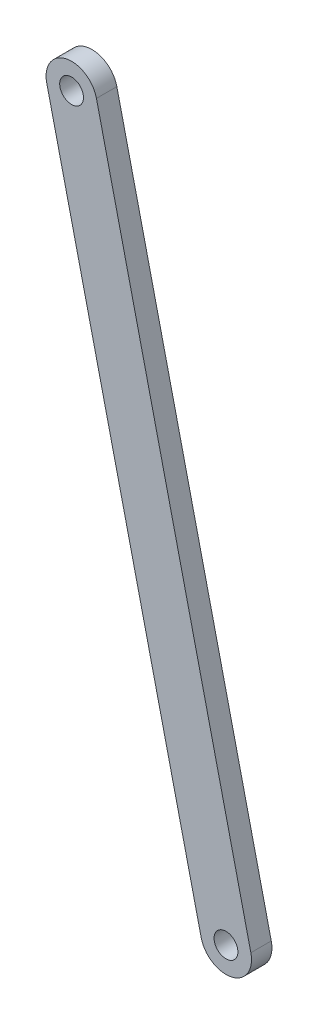
ISO-10303-21;
HEADER;
FILE_DESCRIPTION(('STEP AP214'),'2;1');
FILE_NAME('part.step','',(''),(''),'','','');
FILE_SCHEMA(('AUTOMOTIVE_DESIGN { 1 0 10303 214 1 1 1 1 }'));
ENDSEC;
DATA;
#1=APPLICATION_CONTEXT('core data for automotive mechanical design processes');
#2=APPLICATION_PROTOCOL_DEFINITION('international standard','automotive_design',2000,#1);
#3=PRODUCT_CONTEXT('',#1,'mechanical');
#4=PRODUCT('Part','Part','',(#3));
#5=PRODUCT_RELATED_PRODUCT_CATEGORY('part','',(#4));
#6=PRODUCT_DEFINITION_FORMATION('','',#4);
#7=PRODUCT_DEFINITION_CONTEXT('part definition',#1,'design');
#8=PRODUCT_DEFINITION('design','',#6,#7);
#9=PRODUCT_DEFINITION_SHAPE('','',#8);
#10=(LENGTH_UNIT() NAMED_UNIT(*) SI_UNIT(.MILLI.,.METRE.));
#11=(NAMED_UNIT(*) PLANE_ANGLE_UNIT() SI_UNIT($,.RADIAN.));
#12=(NAMED_UNIT(*) SI_UNIT($,.STERADIAN.) SOLID_ANGLE_UNIT());
#13=UNCERTAINTY_MEASURE_WITH_UNIT(LENGTH_MEASURE(1.E-05),#10,'distance_accuracy_value','');
#14=(GEOMETRIC_REPRESENTATION_CONTEXT(3) GLOBAL_UNCERTAINTY_ASSIGNED_CONTEXT((#13)) GLOBAL_UNIT_ASSIGNED_CONTEXT((#10,
#11,#12)) REPRESENTATION_CONTEXT('',''));
#15=CARTESIAN_POINT('',(0.,0.,0.));
#16=DIRECTION('',(0.,0.,1.));
#17=DIRECTION('',(1.,0.,0.));
#18=AXIS2_PLACEMENT_3D('',#15,#16,#17);
#19=CARTESIAN_POINT('',(-45.3825388255271,-53.2956393127011,6.));
#20=DIRECTION('',(0.,0.,1.));
#21=DIRECTION('',(1.,0.,0.));
#22=AXIS2_PLACEMENT_3D('',#19,#20,#21);
#23=PLANE('',#22);
#24=CARTESIAN_POINT('',(-45.3825388255271,-53.2956393127011,6.));
#25=DIRECTION('',(0.,0.,1.));
#26=DIRECTION('',(1.,0.,0.));
#27=AXIS2_PLACEMENT_3D('',#24,#25,#26);
#28=CIRCLE('',#27,3.5);
#29=CARTESIAN_POINT('',(-41.8825388255271,-53.2956393127011,6.));
#30=VERTEX_POINT('',#29);
#31=EDGE_CURVE('E100',#30,#30,#28,.T.);
#32=ORIENTED_EDGE('',*,*,#31,.F.);
#33=EDGE_LOOP('',(#32));
#34=FACE_BOUND('',#33,.T.);
#35=CARTESIAN_POINT('',(-45.3825388255271,-53.2956393127011,6.));
#36=DIRECTION('',(0.,0.,1.));
#37=DIRECTION('',(1.,0.,0.));
#38=AXIS2_PLACEMENT_3D('',#35,#36,#37);
#39=CIRCLE('',#38,7.5);
#40=CARTESIAN_POINT('',(-38.0781755476664,-51.5937941067438,6.));
#41=VERTEX_POINT('',#40);
#42=CARTESIAN_POINT('',(-52.6869021033878,-54.9974845186583,6.));
#43=VERTEX_POINT('',#42);
#44=EDGE_CURVE('E85',#41,#43,#39,.T.);
#45=ORIENTED_EDGE('',*,*,#44,.T.);
#46=DIRECTION('',(0.226912694127635,-0.973915103714763,0.));
#47=VECTOR('',#46,1.);
#48=CARTESIAN_POINT('',(-52.6869021033878,-54.9974845186583,6.));
#49=LINE('',#48,#47);
#50=CARTESIAN_POINT('',(-7.30436327786072,-249.780505261611,6.));
#51=VERTEX_POINT('',#50);
#52=EDGE_CURVE('E80',#43,#51,#49,.T.);
#53=ORIENTED_EDGE('',*,*,#52,.T.);
#54=CARTESIAN_POINT('',(0.,-248.078660055654,6.));
#55=DIRECTION('',(0.,0.,1.));
#56=DIRECTION('',(1.,0.,0.));
#57=AXIS2_PLACEMENT_3D('',#54,#55,#56);
#58=CIRCLE('',#57,7.49999999999999);
#59=CARTESIAN_POINT('',(7.30436327786072,-246.376814849696,6.));
#60=VERTEX_POINT('',#59);
#61=EDGE_CURVE('E83',#51,#60,#58,.T.);
#62=ORIENTED_EDGE('',*,*,#61,.T.);
#63=DIRECTION('',(-0.226912694127635,0.973915103714763,0.));
#64=VECTOR('',#63,1.);
#65=CARTESIAN_POINT('',(-38.0781755476664,-51.5937941067438,6.));
#66=LINE('',#65,#64);
#67=EDGE_CURVE('E50',#60,#41,#66,.T.);
#68=ORIENTED_EDGE('',*,*,#67,.T.);
#69=EDGE_LOOP('',(#45,#53,#62,#68));
#70=FACE_BOUND('',#69,.T.);
#71=CARTESIAN_POINT('',(0.,-248.078660055654,6.));
#72=DIRECTION('',(0.,0.,1.));
#73=DIRECTION('',(1.,0.,0.));
#74=AXIS2_PLACEMENT_3D('',#71,#72,#73);
#75=CIRCLE('',#74,3.5);
#76=CARTESIAN_POINT('',(3.49999999999999,-248.078660055654,6.));
#77=VERTEX_POINT('',#76);
#78=EDGE_CURVE('E115',#77,#77,#75,.T.);
#79=ORIENTED_EDGE('',*,*,#78,.F.);
#80=EDGE_LOOP('',(#79));
#81=FACE_BOUND('',#80,.T.);
#82=ADVANCED_FACE('F33',(#34,#70,#81),#23,.T.);
#83=CARTESIAN_POINT('',(-45.3825388255271,-53.2956393127011,0.));
#84=DIRECTION('',(0.,0.,1.));
#85=DIRECTION('',(1.,0.,0.));
#86=AXIS2_PLACEMENT_3D('',#83,#84,#85);
#87=PLANE('',#86);
#88=CARTESIAN_POINT('',(-45.3825388255271,-53.2956393127011,0.));
#89=DIRECTION('',(0.,0.,1.));
#90=DIRECTION('',(1.,0.,0.));
#91=AXIS2_PLACEMENT_3D('',#88,#89,#90);
#92=CIRCLE('',#91,7.5);
#93=CARTESIAN_POINT('',(-38.0781755476664,-51.5937941067438,0.));
#94=VERTEX_POINT('',#93);
#95=CARTESIAN_POINT('',(-52.6869021033878,-54.9974845186583,0.));
#96=VERTEX_POINT('',#95);
#97=EDGE_CURVE('E97',#94,#96,#92,.T.);
#98=ORIENTED_EDGE('',*,*,#97,.F.);
#99=DIRECTION('',(-0.226912694127635,0.973915103714763,0.));
#100=VECTOR('',#99,1.);
#101=CARTESIAN_POINT('',(-38.0781755476664,-51.5937941067438,0.));
#102=LINE('',#101,#100);
#103=CARTESIAN_POINT('',(7.30436327786072,-246.376814849696,0.));
#104=VERTEX_POINT('',#103);
#105=EDGE_CURVE('E73',#104,#94,#102,.T.);
#106=ORIENTED_EDGE('',*,*,#105,.F.);
#107=CARTESIAN_POINT('',(0.,-248.078660055654,0.));
#108=DIRECTION('',(0.,0.,1.));
#109=DIRECTION('',(1.,0.,0.));
#110=AXIS2_PLACEMENT_3D('',#107,#108,#109);
#111=CIRCLE('',#110,7.49999999999999);
#112=CARTESIAN_POINT('',(-7.30436327786072,-249.780505261611,0.));
#113=VERTEX_POINT('',#112);
#114=EDGE_CURVE('E67',#113,#104,#111,.T.);
#115=ORIENTED_EDGE('',*,*,#114,.F.);
#116=DIRECTION('',(0.226912694127635,-0.973915103714763,0.));
#117=VECTOR('',#116,1.);
#118=CARTESIAN_POINT('',(-52.6869021033878,-54.9974845186583,0.));
#119=LINE('',#118,#117);
#120=EDGE_CURVE('E89',#96,#113,#119,.T.);
#121=ORIENTED_EDGE('',*,*,#120,.F.);
#122=EDGE_LOOP('',(#98,#106,#115,#121));
#123=FACE_BOUND('',#122,.T.);
#124=CARTESIAN_POINT('',(-45.3825388255271,-53.2956393127011,0.));
#125=DIRECTION('',(0.,0.,1.));
#126=DIRECTION('',(1.,0.,0.));
#127=AXIS2_PLACEMENT_3D('',#124,#125,#126);
#128=CIRCLE('',#127,3.5);
#129=CARTESIAN_POINT('',(-41.8825388255271,-53.2956393127011,0.));
#130=VERTEX_POINT('',#129);
#131=EDGE_CURVE('E112',#130,#130,#128,.T.);
#132=ORIENTED_EDGE('',*,*,#131,.T.);
#133=EDGE_LOOP('',(#132));
#134=FACE_BOUND('',#133,.T.);
#135=CARTESIAN_POINT('',(0.,-248.078660055654,0.));
#136=DIRECTION('',(0.,0.,1.));
#137=DIRECTION('',(1.,0.,0.));
#138=AXIS2_PLACEMENT_3D('',#135,#136,#137);
#139=CIRCLE('',#138,3.5);
#140=CARTESIAN_POINT('',(3.49999999999999,-248.078660055654,0.));
#141=VERTEX_POINT('',#140);
#142=EDGE_CURVE('E118',#141,#141,#139,.T.);
#143=ORIENTED_EDGE('',*,*,#142,.T.);
#144=EDGE_LOOP('',(#143));
#145=FACE_BOUND('',#144,.T.);
#146=ADVANCED_FACE('F108',(#123,#134,#145),#87,.F.);
#147=CARTESIAN_POINT('',(-45.3825388255271,-53.2956393127011,6.));
#148=DIRECTION('',(0.,0.,-1.));
#149=DIRECTION('',(-1.,0.,0.));
#150=AXIS2_PLACEMENT_3D('',#147,#148,#149);
#151=CYLINDRICAL_SURFACE('',#150,7.5);
#152=ORIENTED_EDGE('',*,*,#97,.T.);
#153=DIRECTION('',(0.,0.,-1.));
#154=VECTOR('',#153,1.);
#155=CARTESIAN_POINT('',(-52.6869021033878,-54.9974845186583,6.));
#156=LINE('',#155,#154);
#157=EDGE_CURVE('E11',#43,#96,#156,.T.);
#158=ORIENTED_EDGE('',*,*,#157,.F.);
#159=ORIENTED_EDGE('',*,*,#44,.F.);
#160=DIRECTION('',(0.,0.,-1.));
#161=VECTOR('',#160,1.);
#162=CARTESIAN_POINT('',(-38.0781755476664,-51.5937941067438,6.));
#163=LINE('',#162,#161);
#164=EDGE_CURVE('E93',#41,#94,#163,.T.);
#165=ORIENTED_EDGE('',*,*,#164,.T.);
#166=EDGE_LOOP('',(#152,#158,#159,#165));
#167=FACE_BOUND('',#166,.T.);
#168=ADVANCED_FACE('F35',(#167),#151,.T.);
#169=CARTESIAN_POINT('',(-52.6869021033878,-54.9974845186583,6.));
#170=DIRECTION('',(0.973915103714763,0.226912694127635,0.));
#171=DIRECTION('',(-0.226912694127636,0.973915103714763,0.));
#172=AXIS2_PLACEMENT_3D('',#169,#170,#171);
#173=PLANE('',#172);
#174=ORIENTED_EDGE('',*,*,#120,.T.);
#175=DIRECTION('',(0.,0.,-1.));
#176=VECTOR('',#175,1.);
#177=CARTESIAN_POINT('',(-7.30436327786072,-249.780505261611,6.));
#178=LINE('',#177,#176);
#179=EDGE_CURVE('E42',#51,#113,#178,.T.);
#180=ORIENTED_EDGE('',*,*,#179,.F.);
#181=ORIENTED_EDGE('',*,*,#52,.F.);
#182=ORIENTED_EDGE('',*,*,#157,.T.);
#183=EDGE_LOOP('',(#174,#180,#181,#182));
#184=FACE_BOUND('',#183,.T.);
#185=ADVANCED_FACE('F88',(#184),#173,.F.);
#186=CARTESIAN_POINT('',(0.,-248.078660055654,6.));
#187=DIRECTION('',(0.,0.,-1.));
#188=DIRECTION('',(-1.,0.,0.));
#189=AXIS2_PLACEMENT_3D('',#186,#187,#188);
#190=CYLINDRICAL_SURFACE('',#189,7.49999999999999);
#191=ORIENTED_EDGE('',*,*,#114,.T.);
#192=DIRECTION('',(0.,0.,-1.));
#193=VECTOR('',#192,1.);
#194=CARTESIAN_POINT('',(7.30436327786072,-246.376814849696,6.));
#195=LINE('',#194,#193);
#196=EDGE_CURVE('E90',#60,#104,#195,.T.);
#197=ORIENTED_EDGE('',*,*,#196,.F.);
#198=ORIENTED_EDGE('',*,*,#61,.F.);
#199=ORIENTED_EDGE('',*,*,#179,.T.);
#200=EDGE_LOOP('',(#191,#197,#198,#199));
#201=FACE_BOUND('',#200,.T.);
#202=ADVANCED_FACE('F91',(#201),#190,.T.);
#203=CARTESIAN_POINT('',(-38.0781755476664,-51.5937941067438,6.));
#204=DIRECTION('',(-0.973915103714763,-0.226912694127635,0.));
#205=DIRECTION('',(0.226912694127635,-0.973915103714763,0.));
#206=AXIS2_PLACEMENT_3D('',#203,#204,#205);
#207=PLANE('',#206);
#208=ORIENTED_EDGE('',*,*,#105,.T.);
#209=ORIENTED_EDGE('',*,*,#164,.F.);
#210=ORIENTED_EDGE('',*,*,#67,.F.);
#211=ORIENTED_EDGE('',*,*,#196,.T.);
#212=EDGE_LOOP('',(#208,#209,#210,#211));
#213=FACE_BOUND('',#212,.T.);
#214=ADVANCED_FACE('F105',(#213),#207,.F.);
#215=CARTESIAN_POINT('',(-45.3825388255271,-53.2956393127011,6.));
#216=DIRECTION('',(0.,0.,-1.));
#217=DIRECTION('',(-1.,0.,0.));
#218=AXIS2_PLACEMENT_3D('',#215,#216,#217);
#219=CYLINDRICAL_SURFACE('',#218,3.5);
#220=ORIENTED_EDGE('',*,*,#31,.T.);
#221=EDGE_LOOP('',(#220));
#222=FACE_BOUND('',#221,.T.);
#223=ORIENTED_EDGE('',*,*,#131,.F.);
#224=EDGE_LOOP('',(#223));
#225=FACE_BOUND('',#224,.T.);
#226=ADVANCED_FACE('F135',(#222,#225),#219,.F.);
#227=CARTESIAN_POINT('',(0.,-248.078660055654,6.));
#228=DIRECTION('',(0.,0.,-1.));
#229=DIRECTION('',(-1.,0.,0.));
#230=AXIS2_PLACEMENT_3D('',#227,#228,#229);
#231=CYLINDRICAL_SURFACE('',#230,3.5);
#232=ORIENTED_EDGE('',*,*,#78,.T.);
#233=EDGE_LOOP('',(#232));
#234=FACE_BOUND('',#233,.T.);
#235=ORIENTED_EDGE('',*,*,#142,.F.);
#236=EDGE_LOOP('',(#235));
#237=FACE_BOUND('',#236,.T.);
#238=ADVANCED_FACE('F124',(#234,#237),#231,.F.);
#239=CLOSED_SHELL('',(#82,#146,#168,#185,#202,#214,#226,#238));
#240=MANIFOLD_SOLID_BREP('B2',#239);
#241=ADVANCED_BREP_SHAPE_REPRESENTATION('',(#18,#240),#14);
#242=SHAPE_DEFINITION_REPRESENTATION(#9,#241);
ENDSEC;
END-ISO-10303-21;
